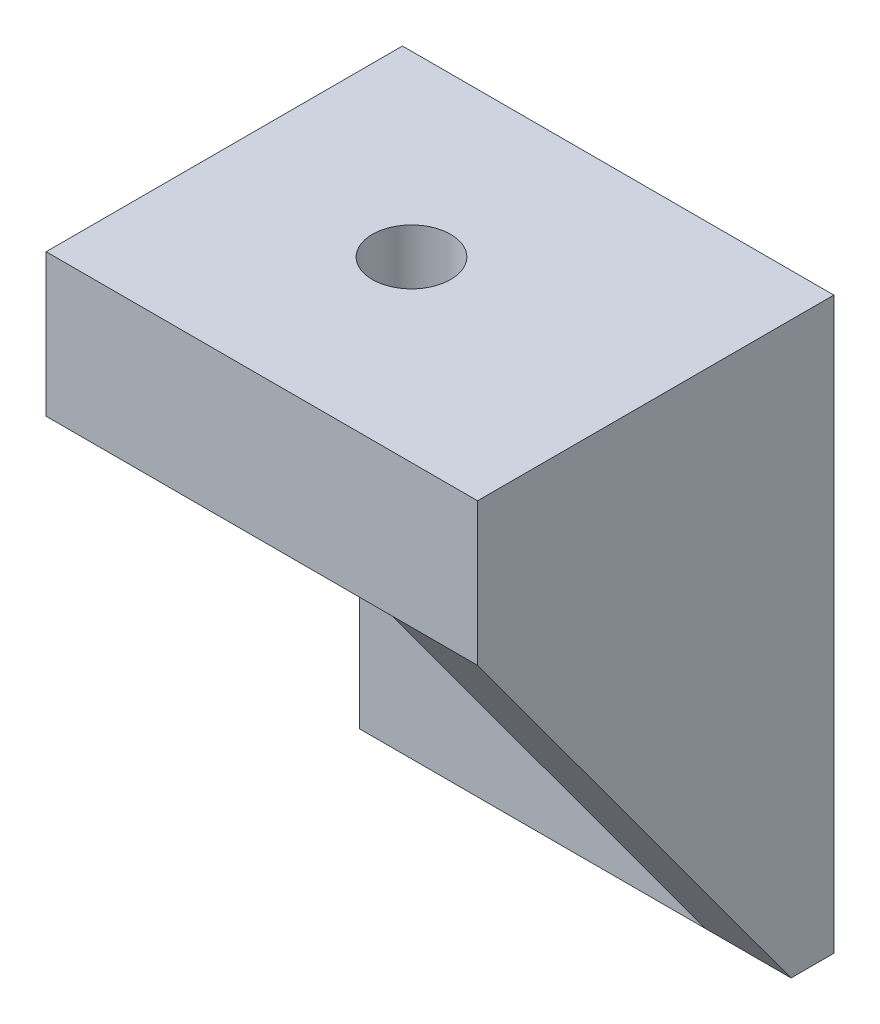
ISO-10303-21;
HEADER;
FILE_DESCRIPTION(('STEP AP214'),'2;1');
FILE_NAME('part.step','',(''),(''),'','','');
FILE_SCHEMA(('AUTOMOTIVE_DESIGN { 1 0 10303 214 1 1 1 1 }'));
ENDSEC;
DATA;
#1=APPLICATION_CONTEXT('core data for automotive mechanical design processes');
#2=APPLICATION_PROTOCOL_DEFINITION('international standard','automotive_design',2000,#1);
#3=PRODUCT_CONTEXT('',#1,'mechanical');
#4=PRODUCT('Part','Part','',(#3));
#5=PRODUCT_RELATED_PRODUCT_CATEGORY('part','',(#4));
#6=PRODUCT_DEFINITION_FORMATION('','',#4);
#7=PRODUCT_DEFINITION_CONTEXT('part definition',#1,'design');
#8=PRODUCT_DEFINITION('design','',#6,#7);
#9=PRODUCT_DEFINITION_SHAPE('','',#8);
#10=(LENGTH_UNIT() NAMED_UNIT(*) SI_UNIT(.MILLI.,.METRE.));
#11=(NAMED_UNIT(*) PLANE_ANGLE_UNIT() SI_UNIT($,.RADIAN.));
#12=(NAMED_UNIT(*) SI_UNIT($,.STERADIAN.) SOLID_ANGLE_UNIT());
#13=UNCERTAINTY_MEASURE_WITH_UNIT(LENGTH_MEASURE(1.E-05),#10,'distance_accuracy_value','');
#14=(GEOMETRIC_REPRESENTATION_CONTEXT(3) GLOBAL_UNCERTAINTY_ASSIGNED_CONTEXT((#13)) GLOBAL_UNIT_ASSIGNED_CONTEXT((#10,
#11,#12)) REPRESENTATION_CONTEXT('',''));
#15=CARTESIAN_POINT('',(0.,0.,0.));
#16=DIRECTION('',(0.,0.,1.));
#17=DIRECTION('',(1.,0.,0.));
#18=AXIS2_PLACEMENT_3D('',#15,#16,#17);
#19=CARTESIAN_POINT('',(0.,5.,0.));
#20=DIRECTION('',(1.,0.,0.));
#21=DIRECTION('',(0.,0.,-1.));
#22=AXIS2_PLACEMENT_3D('',#19,#20,#21);
#23=PLANE('',#22);
#24=DIRECTION('',(0.,-1.,0.));
#25=VECTOR('',#24,1.);
#26=CARTESIAN_POINT('',(0.,5.,-11.));
#27=LINE('',#26,#25);
#28=CARTESIAN_POINT('',(0.,0.,-11.));
#29=VERTEX_POINT('',#28);
#30=CARTESIAN_POINT('',(0.,-15.,-11.));
#31=VERTEX_POINT('',#30);
#32=EDGE_CURVE('E103',#29,#31,#27,.T.);
#33=ORIENTED_EDGE('',*,*,#32,.F.);
#34=DIRECTION('',(0.,0.,-1.));
#35=VECTOR('',#34,1.);
#36=CARTESIAN_POINT('',(0.,0.,0.));
#37=LINE('',#36,#35);
#38=CARTESIAN_POINT('',(0.,0.,0.));
#39=VERTEX_POINT('',#38);
#40=EDGE_CURVE('E112',#39,#29,#37,.T.);
#41=ORIENTED_EDGE('',*,*,#40,.F.);
#42=DIRECTION('',(0.,-1.,0.));
#43=VECTOR('',#42,1.);
#44=CARTESIAN_POINT('',(0.,5.,0.));
#45=LINE('',#44,#43);
#46=CARTESIAN_POINT('',(0.,5.,0.));
#47=VERTEX_POINT('',#46);
#48=EDGE_CURVE('E47',#47,#39,#45,.T.);
#49=ORIENTED_EDGE('',*,*,#48,.F.);
#50=DIRECTION('',(0.,0.,1.));
#51=VECTOR('',#50,1.);
#52=CARTESIAN_POINT('',(0.,5.,0.));
#53=LINE('',#52,#51);
#54=CARTESIAN_POINT('',(0.,5.,-12.5));
#55=VERTEX_POINT('',#54);
#56=EDGE_CURVE('E169',#55,#47,#53,.T.);
#57=ORIENTED_EDGE('',*,*,#56,.F.);
#58=DIRECTION('',(0.,-1.,0.));
#59=VECTOR('',#58,1.);
#60=CARTESIAN_POINT('',(0.,5.,-12.5));
#61=LINE('',#60,#59);
#62=CARTESIAN_POINT('',(0.,-15.,-12.5));
#63=VERTEX_POINT('',#62);
#64=EDGE_CURVE('E180',#55,#63,#61,.T.);
#65=ORIENTED_EDGE('',*,*,#64,.T.);
#66=DIRECTION('',(0.,0.,-1.));
#67=VECTOR('',#66,1.);
#68=CARTESIAN_POINT('',(0.,-15.,-11.));
#69=LINE('',#68,#67);
#70=EDGE_CURVE('E120',#31,#63,#69,.T.);
#71=ORIENTED_EDGE('',*,*,#70,.F.);
#72=EDGE_LOOP('',(#33,#41,#49,#57,#65,#71));
#73=FACE_BOUND('',#72,.T.);
#74=ADVANCED_FACE('F38',(#73),#23,.F.);
#75=CARTESIAN_POINT('',(0.,5.,0.));
#76=DIRECTION('',(0.,0.,-1.));
#77=DIRECTION('',(-1.,0.,0.));
#78=AXIS2_PLACEMENT_3D('',#75,#76,#77);
#79=PLANE('',#78);
#80=DIRECTION('',(1.,0.,0.));
#81=VECTOR('',#80,1.);
#82=CARTESIAN_POINT('',(0.,0.,0.));
#83=LINE('',#82,#81);
#84=CARTESIAN_POINT('',(12.135,0.,0.));
#85=VERTEX_POINT('',#84);
#86=EDGE_CURVE('E54',#39,#85,#83,.T.);
#87=ORIENTED_EDGE('',*,*,#86,.T.);
#88=CARTESIAN_POINT('',(15.135,0.,0.));
#89=VERTEX_POINT('',#88);
#90=EDGE_CURVE('E165',#85,#89,#83,.T.);
#91=ORIENTED_EDGE('',*,*,#90,.T.);
#92=DIRECTION('',(0.,-1.,0.));
#93=VECTOR('',#92,1.);
#94=CARTESIAN_POINT('',(15.135,5.,0.));
#95=LINE('',#94,#93);
#96=CARTESIAN_POINT('',(15.135,5.,0.));
#97=VERTEX_POINT('',#96);
#98=EDGE_CURVE('E188',#97,#89,#95,.T.);
#99=ORIENTED_EDGE('',*,*,#98,.F.);
#100=DIRECTION('',(1.,0.,0.));
#101=VECTOR('',#100,1.);
#102=CARTESIAN_POINT('',(0.,5.,0.));
#103=LINE('',#102,#101);
#104=EDGE_CURVE('E172',#47,#97,#103,.T.);
#105=ORIENTED_EDGE('',*,*,#104,.F.);
#106=ORIENTED_EDGE('',*,*,#48,.T.);
#107=EDGE_LOOP('',(#87,#91,#99,#105,#106));
#108=FACE_BOUND('',#107,.T.);
#109=ADVANCED_FACE('F194',(#108),#79,.F.);
#110=CARTESIAN_POINT('',(15.135,5.,0.));
#111=DIRECTION('',(-1.,0.,0.));
#112=DIRECTION('',(0.,0.,1.));
#113=AXIS2_PLACEMENT_3D('',#110,#111,#112);
#114=PLANE('',#113);
#115=ORIENTED_EDGE('',*,*,#98,.T.);
#116=DIRECTION('',(0.,-0.806404995855705,-0.591363663627517));
#117=VECTOR('',#116,1.);
#118=CARTESIAN_POINT('',(15.135,0.,0.));
#119=LINE('',#118,#117);
#120=CARTESIAN_POINT('',(15.135,-15.,-11.));
#121=VERTEX_POINT('',#120);
#122=EDGE_CURVE('E149',#89,#121,#119,.T.);
#123=ORIENTED_EDGE('',*,*,#122,.T.);
#124=DIRECTION('',(0.,0.,-1.));
#125=VECTOR('',#124,1.);
#126=CARTESIAN_POINT('',(15.135,-15.,-11.));
#127=LINE('',#126,#125);
#128=CARTESIAN_POINT('',(15.135,-15.,-12.5));
#129=VERTEX_POINT('',#128);
#130=EDGE_CURVE('E158',#121,#129,#127,.T.);
#131=ORIENTED_EDGE('',*,*,#130,.T.);
#132=DIRECTION('',(0.,-1.,0.));
#133=VECTOR('',#132,1.);
#134=CARTESIAN_POINT('',(15.135,5.,-12.5));
#135=LINE('',#134,#133);
#136=CARTESIAN_POINT('',(15.135,5.,-12.5));
#137=VERTEX_POINT('',#136);
#138=EDGE_CURVE('E185',#137,#129,#135,.T.);
#139=ORIENTED_EDGE('',*,*,#138,.F.);
#140=DIRECTION('',(0.,0.,-1.));
#141=VECTOR('',#140,1.);
#142=CARTESIAN_POINT('',(15.135,5.,0.));
#143=LINE('',#142,#141);
#144=EDGE_CURVE('E175',#97,#137,#143,.T.);
#145=ORIENTED_EDGE('',*,*,#144,.F.);
#146=EDGE_LOOP('',(#115,#123,#131,#139,#145));
#147=FACE_BOUND('',#146,.T.);
#148=ADVANCED_FACE('F203',(#147),#114,.F.);
#149=CARTESIAN_POINT('',(0.,5.,-12.5));
#150=DIRECTION('',(0.,0.,1.));
#151=DIRECTION('',(1.,0.,0.));
#152=AXIS2_PLACEMENT_3D('',#149,#150,#151);
#153=PLANE('',#152);
#154=CARTESIAN_POINT('',(7.5675,-11.,-12.5));
#155=DIRECTION('',(0.,0.,1.));
#156=DIRECTION('',(1.,0.,0.));
#157=AXIS2_PLACEMENT_3D('',#154,#155,#156);
#158=CIRCLE('',#157,1.375);
#159=CARTESIAN_POINT('',(8.9425,-11.,-12.5));
#160=VERTEX_POINT('',#159);
#161=EDGE_CURVE('E141',#160,#160,#158,.T.);
#162=ORIENTED_EDGE('',*,*,#161,.T.);
#163=EDGE_LOOP('',(#162));
#164=FACE_BOUND('',#163,.T.);
#165=CARTESIAN_POINT('',(7.5675,-4.,-12.5));
#166=DIRECTION('',(0.,0.,1.));
#167=DIRECTION('',(1.,0.,0.));
#168=AXIS2_PLACEMENT_3D('',#165,#166,#167);
#169=CIRCLE('',#168,1.375);
#170=CARTESIAN_POINT('',(8.9425,-4.,-12.5));
#171=VERTEX_POINT('',#170);
#172=EDGE_CURVE('E133',#171,#171,#169,.T.);
#173=ORIENTED_EDGE('',*,*,#172,.T.);
#174=EDGE_LOOP('',(#173));
#175=FACE_BOUND('',#174,.T.);
#176=ORIENTED_EDGE('',*,*,#138,.T.);
#177=DIRECTION('',(-1.,0.,0.));
#178=VECTOR('',#177,1.);
#179=CARTESIAN_POINT('',(15.135,-15.,-12.5));
#180=LINE('',#179,#178);
#181=EDGE_CURVE('E153',#129,#63,#180,.T.);
#182=ORIENTED_EDGE('',*,*,#181,.T.);
#183=ORIENTED_EDGE('',*,*,#64,.F.);
#184=DIRECTION('',(-1.,0.,0.));
#185=VECTOR('',#184,1.);
#186=CARTESIAN_POINT('',(0.,5.,-12.5));
#187=LINE('',#186,#185);
#188=EDGE_CURVE('E62',#137,#55,#187,.T.);
#189=ORIENTED_EDGE('',*,*,#188,.F.);
#190=EDGE_LOOP('',(#176,#182,#183,#189));
#191=FACE_BOUND('',#190,.T.);
#192=ADVANCED_FACE('F207',(#164,#175,#191),#153,.F.);
#193=CARTESIAN_POINT('',(0.,5.,0.));
#194=DIRECTION('',(0.,-1.,0.));
#195=DIRECTION('',(0.,0.,-1.));
#196=AXIS2_PLACEMENT_3D('',#193,#194,#195);
#197=PLANE('',#196);
#198=CARTESIAN_POINT('',(6.5675,5.,-6.25));
#199=DIRECTION('',(0.,1.,0.));
#200=DIRECTION('',(0.,0.,1.));
#201=AXIS2_PLACEMENT_3D('',#198,#199,#200);
#202=CIRCLE('',#201,1.375);
#203=CARTESIAN_POINT('',(6.5675,5.,-4.875));
#204=VERTEX_POINT('',#203);
#205=EDGE_CURVE('E122',#204,#204,#202,.T.);
#206=ORIENTED_EDGE('',*,*,#205,.F.);
#207=EDGE_LOOP('',(#206));
#208=FACE_BOUND('',#207,.T.);
#209=ORIENTED_EDGE('',*,*,#56,.T.);
#210=ORIENTED_EDGE('',*,*,#104,.T.);
#211=ORIENTED_EDGE('',*,*,#144,.T.);
#212=ORIENTED_EDGE('',*,*,#188,.T.);
#213=EDGE_LOOP('',(#209,#210,#211,#212));
#214=FACE_BOUND('',#213,.T.);
#215=ADVANCED_FACE('F197',(#208,#214),#197,.F.);
#216=CARTESIAN_POINT('',(15.135,-15.,-11.));
#217=DIRECTION('',(0.,-1.,0.));
#218=DIRECTION('',(0.,0.,-1.));
#219=AXIS2_PLACEMENT_3D('',#216,#217,#218);
#220=PLANE('',#219);
#221=ORIENTED_EDGE('',*,*,#181,.F.);
#222=ORIENTED_EDGE('',*,*,#130,.F.);
#223=DIRECTION('',(-1.,0.,0.));
#224=VECTOR('',#223,1.);
#225=CARTESIAN_POINT('',(15.135,-15.,-11.));
#226=LINE('',#225,#224);
#227=CARTESIAN_POINT('',(12.135,-15.,-11.));
#228=VERTEX_POINT('',#227);
#229=EDGE_CURVE('E154',#121,#228,#226,.T.);
#230=ORIENTED_EDGE('',*,*,#229,.T.);
#231=EDGE_CURVE('E159',#228,#31,#226,.T.);
#232=ORIENTED_EDGE('',*,*,#231,.T.);
#233=ORIENTED_EDGE('',*,*,#70,.T.);
#234=EDGE_LOOP('',(#221,#222,#230,#232,#233));
#235=FACE_BOUND('',#234,.T.);
#236=ADVANCED_FACE('F209',(#235),#220,.T.);
#237=CARTESIAN_POINT('',(33.7360752377383,0.,0.));
#238=DIRECTION('',(0.,-0.591363663627517,0.806404995855705));
#239=DIRECTION('',(0.,-0.806404995855705,-0.591363663627517));
#240=AXIS2_PLACEMENT_3D('',#237,#238,#239);
#241=PLANE('',#240);
#242=DIRECTION('',(0.,0.806404995855705,0.591363663627517));
#243=VECTOR('',#242,1.);
#244=CARTESIAN_POINT('',(12.135,0.,0.));
#245=LINE('',#244,#243);
#246=EDGE_CURVE('E11',#228,#85,#245,.T.);
#247=ORIENTED_EDGE('',*,*,#246,.F.);
#248=ORIENTED_EDGE('',*,*,#229,.F.);
#249=ORIENTED_EDGE('',*,*,#122,.F.);
#250=ORIENTED_EDGE('',*,*,#90,.F.);
#251=EDGE_LOOP('',(#247,#248,#249,#250));
#252=FACE_BOUND('',#251,.T.);
#253=ADVANCED_FACE('F257',(#252),#241,.T.);
#254=CARTESIAN_POINT('',(3.,0.,-11.));
#255=DIRECTION('',(0.,1.,0.));
#256=DIRECTION('',(0.,0.,1.));
#257=AXIS2_PLACEMENT_3D('',#254,#255,#256);
#258=PLANE('',#257);
#259=CARTESIAN_POINT('',(6.5675,0.,-6.25));
#260=DIRECTION('',(0.,1.,0.));
#261=DIRECTION('',(0.,0.,1.));
#262=AXIS2_PLACEMENT_3D('',#259,#260,#261);
#263=CIRCLE('',#262,1.375);
#264=CARTESIAN_POINT('',(6.5675,0.,-4.875));
#265=VERTEX_POINT('',#264);
#266=EDGE_CURVE('E41',#265,#265,#263,.T.);
#267=ORIENTED_EDGE('',*,*,#266,.T.);
#268=EDGE_LOOP('',(#267));
#269=FACE_BOUND('',#268,.T.);
#270=DIRECTION('',(0.,0.,1.));
#271=VECTOR('',#270,1.);
#272=CARTESIAN_POINT('',(12.135,0.,-11.));
#273=LINE('',#272,#271);
#274=CARTESIAN_POINT('',(12.135,0.,-11.));
#275=VERTEX_POINT('',#274);
#276=EDGE_CURVE('E109',#275,#85,#273,.T.);
#277=ORIENTED_EDGE('',*,*,#276,.T.);
#278=ORIENTED_EDGE('',*,*,#86,.F.);
#279=ORIENTED_EDGE('',*,*,#40,.T.);
#280=DIRECTION('',(-1.,0.,0.));
#281=VECTOR('',#280,1.);
#282=CARTESIAN_POINT('',(3.,0.,-11.));
#283=LINE('',#282,#281);
#284=EDGE_CURVE('E99',#275,#29,#283,.T.);
#285=ORIENTED_EDGE('',*,*,#284,.F.);
#286=EDGE_LOOP('',(#277,#278,#279,#285));
#287=FACE_BOUND('',#286,.T.);
#288=ADVANCED_FACE('F113',(#269,#287),#258,.F.);
#289=CARTESIAN_POINT('',(12.135,0.,-11.));
#290=DIRECTION('',(1.,0.,0.));
#291=DIRECTION('',(0.,1.,0.));
#292=AXIS2_PLACEMENT_3D('',#289,#290,#291);
#293=PLANE('',#292);
#294=ORIENTED_EDGE('',*,*,#246,.T.);
#295=ORIENTED_EDGE('',*,*,#276,.F.);
#296=DIRECTION('',(0.,1.,0.));
#297=VECTOR('',#296,1.);
#298=CARTESIAN_POINT('',(12.135,0.,-11.));
#299=LINE('',#298,#297);
#300=EDGE_CURVE('E106',#228,#275,#299,.T.);
#301=ORIENTED_EDGE('',*,*,#300,.F.);
#302=EDGE_LOOP('',(#294,#295,#301));
#303=FACE_BOUND('',#302,.T.);
#304=ADVANCED_FACE('F261',(#303),#293,.F.);
#305=CARTESIAN_POINT('',(0.,0.,-11.));
#306=DIRECTION('',(0.,0.,1.));
#307=DIRECTION('',(1.,0.,0.));
#308=AXIS2_PLACEMENT_3D('',#305,#306,#307);
#309=PLANE('',#308);
#310=CARTESIAN_POINT('',(7.5675,-11.,-11.));
#311=DIRECTION('',(0.,0.,1.));
#312=DIRECTION('',(1.,0.,0.));
#313=AXIS2_PLACEMENT_3D('',#310,#311,#312);
#314=CIRCLE('',#313,1.375);
#315=CARTESIAN_POINT('',(8.9425,-11.,-11.));
#316=VERTEX_POINT('',#315);
#317=EDGE_CURVE('E129',#316,#316,#314,.T.);
#318=ORIENTED_EDGE('',*,*,#317,.F.);
#319=EDGE_LOOP('',(#318));
#320=FACE_BOUND('',#319,.T.);
#321=CARTESIAN_POINT('',(7.5675,-4.,-11.));
#322=DIRECTION('',(0.,0.,1.));
#323=DIRECTION('',(1.,0.,0.));
#324=AXIS2_PLACEMENT_3D('',#321,#322,#323);
#325=CIRCLE('',#324,1.375);
#326=CARTESIAN_POINT('',(8.9425,-4.,-11.));
#327=VERTEX_POINT('',#326);
#328=EDGE_CURVE('E134',#327,#327,#325,.T.);
#329=ORIENTED_EDGE('',*,*,#328,.F.);
#330=EDGE_LOOP('',(#329));
#331=FACE_BOUND('',#330,.T.);
#332=ORIENTED_EDGE('',*,*,#284,.T.);
#333=ORIENTED_EDGE('',*,*,#32,.T.);
#334=ORIENTED_EDGE('',*,*,#231,.F.);
#335=ORIENTED_EDGE('',*,*,#300,.T.);
#336=EDGE_LOOP('',(#332,#333,#334,#335));
#337=FACE_BOUND('',#336,.T.);
#338=ADVANCED_FACE('F101',(#320,#331,#337),#309,.T.);
#339=CARTESIAN_POINT('',(7.5675,-4.,-13.));
#340=DIRECTION('',(0.,0.,1.));
#341=DIRECTION('',(1.,0.,0.));
#342=AXIS2_PLACEMENT_3D('',#339,#340,#341);
#343=CYLINDRICAL_SURFACE('',#342,1.375);
#344=ORIENTED_EDGE('',*,*,#328,.T.);
#345=EDGE_LOOP('',(#344));
#346=FACE_BOUND('',#345,.T.);
#347=ORIENTED_EDGE('',*,*,#172,.F.);
#348=EDGE_LOOP('',(#347));
#349=FACE_BOUND('',#348,.T.);
#350=ADVANCED_FACE('F237',(#346,#349),#343,.F.);
#351=CARTESIAN_POINT('',(7.5675,-11.,-13.));
#352=DIRECTION('',(0.,0.,1.));
#353=DIRECTION('',(1.,0.,0.));
#354=AXIS2_PLACEMENT_3D('',#351,#352,#353);
#355=CYLINDRICAL_SURFACE('',#354,1.375);
#356=ORIENTED_EDGE('',*,*,#317,.T.);
#357=EDGE_LOOP('',(#356));
#358=FACE_BOUND('',#357,.T.);
#359=ORIENTED_EDGE('',*,*,#161,.F.);
#360=EDGE_LOOP('',(#359));
#361=FACE_BOUND('',#360,.T.);
#362=ADVANCED_FACE('F231',(#358,#361),#355,.F.);
#363=CARTESIAN_POINT('',(6.5675,-0.75,-6.25));
#364=DIRECTION('',(0.,1.,0.));
#365=DIRECTION('',(0.,0.,1.));
#366=AXIS2_PLACEMENT_3D('',#363,#364,#365);
#367=CYLINDRICAL_SURFACE('',#366,1.375);
#368=ORIENTED_EDGE('',*,*,#205,.T.);
#369=EDGE_LOOP('',(#368));
#370=FACE_BOUND('',#369,.T.);
#371=ORIENTED_EDGE('',*,*,#266,.F.);
#372=EDGE_LOOP('',(#371));
#373=FACE_BOUND('',#372,.T.);
#374=ADVANCED_FACE('F229',(#370,#373),#367,.F.);
#375=CLOSED_SHELL('',(#74,#109,#148,#192,#215,#236,#253,#288,#304,#338,#350,#362,#374));
#376=MANIFOLD_SOLID_BREP('B2',#375);
#377=ADVANCED_BREP_SHAPE_REPRESENTATION('',(#18,#376),#14);
#378=SHAPE_DEFINITION_REPRESENTATION(#9,#377);
ENDSEC;
END-ISO-10303-21;
